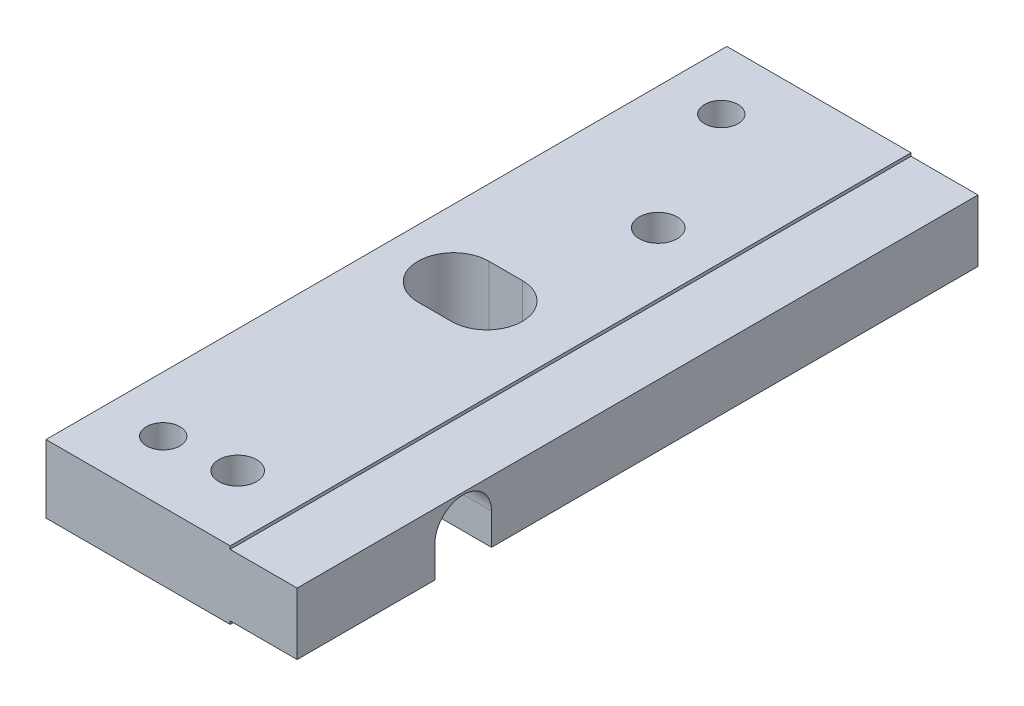
ISO-10303-21;
HEADER;
FILE_DESCRIPTION(('STEP AP214'),'2;1');
FILE_NAME('part.step','',(''),(''),'','','');
FILE_SCHEMA(('AUTOMOTIVE_DESIGN { 1 0 10303 214 1 1 1 1 }'));
ENDSEC;
DATA;
#1=APPLICATION_CONTEXT('core data for automotive mechanical design processes');
#2=APPLICATION_PROTOCOL_DEFINITION('international standard','automotive_design',2000,#1);
#3=PRODUCT_CONTEXT('',#1,'mechanical');
#4=PRODUCT('Part','Part','',(#3));
#5=PRODUCT_RELATED_PRODUCT_CATEGORY('part','',(#4));
#6=PRODUCT_DEFINITION_FORMATION('','',#4);
#7=PRODUCT_DEFINITION_CONTEXT('part definition',#1,'design');
#8=PRODUCT_DEFINITION('design','',#6,#7);
#9=PRODUCT_DEFINITION_SHAPE('','',#8);
#10=(LENGTH_UNIT() NAMED_UNIT(*) SI_UNIT(.MILLI.,.METRE.));
#11=(NAMED_UNIT(*) PLANE_ANGLE_UNIT() SI_UNIT($,.RADIAN.));
#12=(NAMED_UNIT(*) SI_UNIT($,.STERADIAN.) SOLID_ANGLE_UNIT());
#13=UNCERTAINTY_MEASURE_WITH_UNIT(LENGTH_MEASURE(1.E-05),#10,'distance_accuracy_value','');
#14=(GEOMETRIC_REPRESENTATION_CONTEXT(3) GLOBAL_UNCERTAINTY_ASSIGNED_CONTEXT((#13)) GLOBAL_UNIT_ASSIGNED_CONTEXT((#10,
#11,#12)) REPRESENTATION_CONTEXT('',''));
#15=CARTESIAN_POINT('',(0.,0.,0.));
#16=DIRECTION('',(0.,0.,1.));
#17=DIRECTION('',(1.,0.,0.));
#18=AXIS2_PLACEMENT_3D('',#15,#16,#17);
#19=CARTESIAN_POINT('',(22.5,-3.05,0.));
#20=DIRECTION('',(0.,1.,0.));
#21=DIRECTION('',(0.,0.,1.));
#22=AXIS2_PLACEMENT_3D('',#19,#20,#21);
#23=PLANE('',#22);
#24=CARTESIAN_POINT('',(11.,-3.05,-6.175));
#25=DIRECTION('',(0.,-1.,0.));
#26=DIRECTION('',(0.,0.,-1.));
#27=AXIS2_PLACEMENT_3D('',#24,#25,#26);
#28=CIRCLE('',#27,3.25);
#29=CARTESIAN_POINT('',(11.,-3.05,-9.425));
#30=VERTEX_POINT('',#29);
#31=EDGE_CURVE('E404',#30,#30,#28,.T.);
#32=ORIENTED_EDGE('',*,*,#31,.F.);
#33=EDGE_LOOP('',(#32));
#34=FACE_BOUND('',#33,.T.);
#35=CARTESIAN_POINT('',(5.00000000000001,-3.05,-5.5));
#36=DIRECTION('',(0.,1.,0.));
#37=DIRECTION('',(0.,0.,1.));
#38=AXIS2_PLACEMENT_3D('',#35,#36,#37);
#39=CIRCLE('',#38,1.5);
#40=CARTESIAN_POINT('',(5.00000000000001,-3.05,-4.));
#41=VERTEX_POINT('',#40);
#42=EDGE_CURVE('E378',#41,#41,#39,.T.);
#43=ORIENTED_EDGE('',*,*,#42,.T.);
#44=EDGE_LOOP('',(#43));
#45=FACE_BOUND('',#44,.T.);
#46=DIRECTION('',(0.,0.,-1.));
#47=VECTOR('',#46,1.);
#48=CARTESIAN_POINT('',(0.,-3.05,0.));
#49=LINE('',#48,#47);
#50=CARTESIAN_POINT('',(0.,-3.05,0.));
#51=VERTEX_POINT('',#50);
#52=CARTESIAN_POINT('',(0.,-3.05,-12.3486));
#53=VERTEX_POINT('',#52);
#54=EDGE_CURVE('E277',#51,#53,#49,.T.);
#55=ORIENTED_EDGE('',*,*,#54,.T.);
#56=DIRECTION('',(-1.,0.,0.));
#57=VECTOR('',#56,1.);
#58=CARTESIAN_POINT('',(22.5,-3.05,-12.3486));
#59=LINE('',#58,#57);
#60=CARTESIAN_POINT('',(16.5,-3.05,-12.3486));
#61=VERTEX_POINT('',#60);
#62=EDGE_CURVE('E221',#61,#53,#59,.T.);
#63=ORIENTED_EDGE('',*,*,#62,.F.);
#64=DIRECTION('',(0.,0.,-1.));
#65=VECTOR('',#64,1.);
#66=CARTESIAN_POINT('',(16.5,-3.05,0.));
#67=LINE('',#66,#65);
#68=CARTESIAN_POINT('',(16.5,-3.05,0.));
#69=VERTEX_POINT('',#68);
#70=EDGE_CURVE('E261',#69,#61,#67,.T.);
#71=ORIENTED_EDGE('',*,*,#70,.F.);
#72=DIRECTION('',(-1.,0.,0.));
#73=VECTOR('',#72,1.);
#74=CARTESIAN_POINT('',(22.5,-3.05,0.));
#75=LINE('',#74,#73);
#76=EDGE_CURVE('E291',#69,#51,#75,.T.);
#77=ORIENTED_EDGE('',*,*,#76,.T.);
#78=EDGE_LOOP('',(#55,#63,#71,#77));
#79=FACE_BOUND('',#78,.T.);
#80=ADVANCED_FACE('F36',(#34,#45,#79),#23,.F.);
#81=CARTESIAN_POINT('',(16.5,-2.775,0.));
#82=DIRECTION('',(0.,-1.,0.));
#83=DIRECTION('',(0.,0.,-1.));
#84=AXIS2_PLACEMENT_3D('',#81,#82,#83);
#85=PLANE('',#84);
#86=DIRECTION('',(-1.,0.,0.));
#87=VECTOR('',#86,1.);
#88=CARTESIAN_POINT('',(16.5,-2.775,-12.3486));
#89=LINE('',#88,#87);
#90=CARTESIAN_POINT('',(22.5,-2.775,-12.3486));
#91=VERTEX_POINT('',#90);
#92=CARTESIAN_POINT('',(16.5,-2.775,-12.3486));
#93=VERTEX_POINT('',#92);
#94=EDGE_CURVE('E228',#91,#93,#89,.T.);
#95=ORIENTED_EDGE('',*,*,#94,.F.);
#96=DIRECTION('',(0.,0.,-1.));
#97=VECTOR('',#96,1.);
#98=CARTESIAN_POINT('',(22.5,-2.775,0.));
#99=LINE('',#98,#97);
#100=CARTESIAN_POINT('',(22.5,-2.775,0.));
#101=VERTEX_POINT('',#100);
#102=EDGE_CURVE('E239',#101,#91,#99,.T.);
#103=ORIENTED_EDGE('',*,*,#102,.F.);
#104=DIRECTION('',(1.,0.,0.));
#105=VECTOR('',#104,1.);
#106=CARTESIAN_POINT('',(16.5,-2.775,0.));
#107=LINE('',#106,#105);
#108=CARTESIAN_POINT('',(16.5,-2.775,0.));
#109=VERTEX_POINT('',#108);
#110=EDGE_CURVE('E238',#109,#101,#107,.T.);
#111=ORIENTED_EDGE('',*,*,#110,.F.);
#112=DIRECTION('',(0.,0.,-1.));
#113=VECTOR('',#112,1.);
#114=CARTESIAN_POINT('',(16.5,-2.775,0.));
#115=LINE('',#114,#113);
#116=EDGE_CURVE('E231',#109,#93,#115,.T.);
#117=ORIENTED_EDGE('',*,*,#116,.T.);
#118=EDGE_LOOP('',(#95,#103,#111,#117));
#119=FACE_BOUND('',#118,.T.);
#120=ADVANCED_FACE('F355',(#119),#85,.T.);
#121=CARTESIAN_POINT('',(16.5,0.,-30.5));
#122=DIRECTION('',(1.,0.,0.));
#123=DIRECTION('',(0.,0.,-1.));
#124=AXIS2_PLACEMENT_3D('',#121,#122,#123);
#125=PLANE('',#124);
#126=DIRECTION('',(0.,-1.,0.));
#127=VECTOR('',#126,1.);
#128=CARTESIAN_POINT('',(16.5,0.,-12.3486));
#129=LINE('',#128,#127);
#130=EDGE_CURVE('E12',#93,#61,#129,.T.);
#131=ORIENTED_EDGE('',*,*,#130,.F.);
#132=ORIENTED_EDGE('',*,*,#116,.F.);
#133=DIRECTION('',(0.,-1.,0.));
#134=VECTOR('',#133,1.);
#135=CARTESIAN_POINT('',(16.5,-3.05,0.));
#136=LINE('',#135,#134);
#137=EDGE_CURVE('E260',#109,#69,#136,.T.);
#138=ORIENTED_EDGE('',*,*,#137,.T.);
#139=ORIENTED_EDGE('',*,*,#70,.T.);
#140=EDGE_LOOP('',(#131,#132,#138,#139));
#141=FACE_BOUND('',#140,.T.);
#142=ADVANCED_FACE('F352',(#141),#125,.T.);
#143=CARTESIAN_POINT('',(22.5,-3.05,0.));
#144=DIRECTION('',(0.,0.,-1.));
#145=DIRECTION('',(-1.,0.,0.));
#146=AXIS2_PLACEMENT_3D('',#143,#144,#145);
#147=PLANE('',#146);
#148=DIRECTION('',(1.,0.,0.));
#149=VECTOR('',#148,1.);
#150=CARTESIAN_POINT('',(16.5,2.775,0.));
#151=LINE('',#150,#149);
#152=CARTESIAN_POINT('',(16.5,2.775,0.));
#153=VERTEX_POINT('',#152);
#154=CARTESIAN_POINT('',(22.5,2.775,0.));
#155=VERTEX_POINT('',#154);
#156=EDGE_CURVE('E245',#153,#155,#151,.T.);
#157=ORIENTED_EDGE('',*,*,#156,.F.);
#158=CARTESIAN_POINT('',(16.5,3.05,0.));
#159=VERTEX_POINT('',#158);
#160=EDGE_CURVE('E257',#159,#153,#136,.T.);
#161=ORIENTED_EDGE('',*,*,#160,.F.);
#162=DIRECTION('',(-1.,0.,0.));
#163=VECTOR('',#162,1.);
#164=CARTESIAN_POINT('',(22.5,3.05,0.));
#165=LINE('',#164,#163);
#166=CARTESIAN_POINT('',(0.,3.05,0.));
#167=VERTEX_POINT('',#166);
#168=EDGE_CURVE('E272',#159,#167,#165,.T.);
#169=ORIENTED_EDGE('',*,*,#168,.T.);
#170=DIRECTION('',(0.,-1.,0.));
#171=VECTOR('',#170,1.);
#172=CARTESIAN_POINT('',(0.,-3.05,0.));
#173=LINE('',#172,#171);
#174=EDGE_CURVE('E273',#167,#51,#173,.T.);
#175=ORIENTED_EDGE('',*,*,#174,.T.);
#176=ORIENTED_EDGE('',*,*,#76,.F.);
#177=ORIENTED_EDGE('',*,*,#137,.F.);
#178=ORIENTED_EDGE('',*,*,#110,.T.);
#179=DIRECTION('',(0.,-1.,0.));
#180=VECTOR('',#179,1.);
#181=CARTESIAN_POINT('',(22.5,-3.05,0.));
#182=LINE('',#181,#180);
#183=EDGE_CURVE('E265',#155,#101,#182,.T.);
#184=ORIENTED_EDGE('',*,*,#183,.F.);
#185=EDGE_LOOP('',(#157,#161,#169,#175,#176,#177,#178,#184));
#186=FACE_BOUND('',#185,.T.);
#187=ADVANCED_FACE('F38',(#186),#147,.F.);
#188=CARTESIAN_POINT('',(11.,-3.05,-43.85));
#189=DIRECTION('',(0.,-1.,0.));
#190=DIRECTION('',(0.,0.,-1.));
#191=AXIS2_PLACEMENT_3D('',#188,#189,#190);
#192=CIRCLE('',#191,3.25);
#193=CARTESIAN_POINT('',(11.,-3.05,-47.1));
#194=VERTEX_POINT('',#193);
#195=EDGE_CURVE('E373',#194,#194,#192,.T.);
#196=ORIENTED_EDGE('',*,*,#195,.F.);
#197=EDGE_LOOP('',(#196));
#198=FACE_BOUND('',#197,.T.);
#199=CARTESIAN_POINT('',(5.,-3.05,-55.5));
#200=DIRECTION('',(0.,1.,0.));
#201=DIRECTION('',(0.,0.,1.));
#202=AXIS2_PLACEMENT_3D('',#199,#200,#201);
#203=CIRCLE('',#202,1.5);
#204=CARTESIAN_POINT('',(5.,-3.05,-54.));
#205=VERTEX_POINT('',#204);
#206=EDGE_CURVE('E191',#205,#205,#203,.T.);
#207=ORIENTED_EDGE('',*,*,#206,.T.);
#208=EDGE_LOOP('',(#207));
#209=FACE_BOUND('',#208,.T.);
#210=DIRECTION('',(1.,0.,0.));
#211=VECTOR('',#210,1.);
#212=CARTESIAN_POINT('',(9.00000000000001,-3.05,-27.325));
#213=LINE('',#212,#211);
#214=CARTESIAN_POINT('',(6.,-3.05,-27.325));
#215=VERTEX_POINT('',#214);
#216=CARTESIAN_POINT('',(9.00000000000001,-3.05,-27.325));
#217=VERTEX_POINT('',#216);
#218=EDGE_CURVE('E168',#215,#217,#213,.T.);
#219=ORIENTED_EDGE('',*,*,#218,.T.);
#220=CARTESIAN_POINT('',(9.00000000000001,-3.05,-30.5));
#221=DIRECTION('',(0.,1.,0.));
#222=DIRECTION('',(0.,0.,1.));
#223=AXIS2_PLACEMENT_3D('',#220,#221,#222);
#224=CIRCLE('',#223,3.175);
#225=CARTESIAN_POINT('',(9.00000000000001,-3.05,-33.675));
#226=VERTEX_POINT('',#225);
#227=EDGE_CURVE('E162',#217,#226,#224,.T.);
#228=ORIENTED_EDGE('',*,*,#227,.T.);
#229=DIRECTION('',(-1.,0.,0.));
#230=VECTOR('',#229,1.);
#231=CARTESIAN_POINT('',(9.00000000000001,-3.05,-33.675));
#232=LINE('',#231,#230);
#233=CARTESIAN_POINT('',(6.00000000000001,-3.05,-33.675));
#234=VERTEX_POINT('',#233);
#235=EDGE_CURVE('E171',#226,#234,#232,.T.);
#236=ORIENTED_EDGE('',*,*,#235,.T.);
#237=CARTESIAN_POINT('',(6.,-3.05,-30.5));
#238=DIRECTION('',(0.,1.,0.));
#239=DIRECTION('',(0.,0.,1.));
#240=AXIS2_PLACEMENT_3D('',#237,#238,#239);
#241=CIRCLE('',#240,3.175);
#242=EDGE_CURVE('E51',#234,#215,#241,.T.);
#243=ORIENTED_EDGE('',*,*,#242,.T.);
#244=EDGE_LOOP('',(#219,#228,#236,#243));
#245=FACE_BOUND('',#244,.T.);
#246=CARTESIAN_POINT('',(16.5,-3.05,-17.4134));
#247=VERTEX_POINT('',#246);
#248=CARTESIAN_POINT('',(16.5,-3.05,-61.));
#249=VERTEX_POINT('',#248);
#250=EDGE_CURVE('E264',#247,#249,#67,.T.);
#251=ORIENTED_EDGE('',*,*,#250,.F.);
#252=DIRECTION('',(-1.,0.,0.));
#253=VECTOR('',#252,1.);
#254=CARTESIAN_POINT('',(22.5,-3.05,-17.4134));
#255=LINE('',#254,#253);
#256=CARTESIAN_POINT('',(0.,-3.05,-17.4134));
#257=VERTEX_POINT('',#256);
#258=EDGE_CURVE('E223',#247,#257,#255,.T.);
#259=ORIENTED_EDGE('',*,*,#258,.T.);
#260=CARTESIAN_POINT('',(0.,-3.05,-61.));
#261=VERTEX_POINT('',#260);
#262=EDGE_CURVE('E276',#257,#261,#49,.T.);
#263=ORIENTED_EDGE('',*,*,#262,.T.);
#264=DIRECTION('',(-1.,0.,0.));
#265=VECTOR('',#264,1.);
#266=CARTESIAN_POINT('',(22.5,-3.05,-61.));
#267=LINE('',#266,#265);
#268=EDGE_CURVE('E288',#249,#261,#267,.T.);
#269=ORIENTED_EDGE('',*,*,#268,.F.);
#270=EDGE_LOOP('',(#251,#259,#263,#269));
#271=FACE_BOUND('',#270,.T.);
#272=ADVANCED_FACE('F175',(#198,#209,#245,#271),#23,.F.);
#273=CARTESIAN_POINT('',(22.5,-3.05,-61.));
#274=DIRECTION('',(0.,0.,1.));
#275=DIRECTION('',(1.,0.,0.));
#276=AXIS2_PLACEMENT_3D('',#273,#274,#275);
#277=PLANE('',#276);
#278=DIRECTION('',(1.,0.,0.));
#279=VECTOR('',#278,1.);
#280=CARTESIAN_POINT('',(16.5,2.775,-61.));
#281=LINE('',#280,#279);
#282=CARTESIAN_POINT('',(16.5,2.775,-61.));
#283=VERTEX_POINT('',#282);
#284=CARTESIAN_POINT('',(22.5,2.775,-61.));
#285=VERTEX_POINT('',#284);
#286=EDGE_CURVE('E248',#283,#285,#281,.T.);
#287=ORIENTED_EDGE('',*,*,#286,.T.);
#288=DIRECTION('',(0.,1.,0.));
#289=VECTOR('',#288,1.);
#290=CARTESIAN_POINT('',(22.5,-3.05,-61.));
#291=LINE('',#290,#289);
#292=CARTESIAN_POINT('',(22.5,-2.775,-61.));
#293=VERTEX_POINT('',#292);
#294=EDGE_CURVE('E268',#293,#285,#291,.T.);
#295=ORIENTED_EDGE('',*,*,#294,.F.);
#296=DIRECTION('',(1.,0.,0.));
#297=VECTOR('',#296,1.);
#298=CARTESIAN_POINT('',(16.5,-2.775,-61.));
#299=LINE('',#298,#297);
#300=CARTESIAN_POINT('',(16.5,-2.775,-61.));
#301=VERTEX_POINT('',#300);
#302=EDGE_CURVE('E251',#301,#293,#299,.T.);
#303=ORIENTED_EDGE('',*,*,#302,.F.);
#304=DIRECTION('',(0.,1.,0.));
#305=VECTOR('',#304,1.);
#306=CARTESIAN_POINT('',(16.5,-3.05,-61.));
#307=LINE('',#306,#305);
#308=EDGE_CURVE('E258',#249,#301,#307,.T.);
#309=ORIENTED_EDGE('',*,*,#308,.F.);
#310=ORIENTED_EDGE('',*,*,#268,.T.);
#311=DIRECTION('',(0.,1.,0.));
#312=VECTOR('',#311,1.);
#313=CARTESIAN_POINT('',(0.,-3.05,-61.));
#314=LINE('',#313,#312);
#315=CARTESIAN_POINT('',(0.,3.05,-61.));
#316=VERTEX_POINT('',#315);
#317=EDGE_CURVE('E280',#261,#316,#314,.T.);
#318=ORIENTED_EDGE('',*,*,#317,.T.);
#319=DIRECTION('',(-1.,0.,0.));
#320=VECTOR('',#319,1.);
#321=CARTESIAN_POINT('',(22.5,3.05,-61.));
#322=LINE('',#321,#320);
#323=CARTESIAN_POINT('',(16.5,3.05,-61.));
#324=VERTEX_POINT('',#323);
#325=EDGE_CURVE('E286',#324,#316,#322,.T.);
#326=ORIENTED_EDGE('',*,*,#325,.F.);
#327=EDGE_CURVE('E247',#283,#324,#307,.T.);
#328=ORIENTED_EDGE('',*,*,#327,.F.);
#329=EDGE_LOOP('',(#287,#295,#303,#309,#310,#318,#326,#328));
#330=FACE_BOUND('',#329,.T.);
#331=ADVANCED_FACE('F312',(#330),#277,.F.);
#332=CARTESIAN_POINT('',(22.5,3.05,0.));
#333=DIRECTION('',(0.,-1.,0.));
#334=DIRECTION('',(0.,0.,-1.));
#335=AXIS2_PLACEMENT_3D('',#332,#333,#334);
#336=PLANE('',#335);
#337=CARTESIAN_POINT('',(11.,3.05,-6.175));
#338=DIRECTION('',(0.,-1.,0.));
#339=DIRECTION('',(0.,0.,-1.));
#340=AXIS2_PLACEMENT_3D('',#337,#338,#339);
#341=CIRCLE('',#340,1.7);
#342=CARTESIAN_POINT('',(11.,3.05,-7.875));
#343=VERTEX_POINT('',#342);
#344=EDGE_CURVE('E395',#343,#343,#341,.T.);
#345=ORIENTED_EDGE('',*,*,#344,.T.);
#346=EDGE_LOOP('',(#345));
#347=FACE_BOUND('',#346,.T.);
#348=CARTESIAN_POINT('',(11.,3.05,-43.85));
#349=DIRECTION('',(0.,-1.,0.));
#350=DIRECTION('',(0.,0.,-1.));
#351=AXIS2_PLACEMENT_3D('',#348,#349,#350);
#352=CIRCLE('',#351,1.7);
#353=CARTESIAN_POINT('',(11.,3.05,-45.55));
#354=VERTEX_POINT('',#353);
#355=EDGE_CURVE('E383',#354,#354,#352,.T.);
#356=ORIENTED_EDGE('',*,*,#355,.T.);
#357=EDGE_LOOP('',(#356));
#358=FACE_BOUND('',#357,.T.);
#359=CARTESIAN_POINT('',(5.00000000000001,3.05,-5.5));
#360=DIRECTION('',(0.,1.,0.));
#361=DIRECTION('',(0.,0.,1.));
#362=AXIS2_PLACEMENT_3D('',#359,#360,#361);
#363=CIRCLE('',#362,1.5);
#364=CARTESIAN_POINT('',(5.00000000000001,3.05,-4.));
#365=VERTEX_POINT('',#364);
#366=EDGE_CURVE('E380',#365,#365,#363,.T.);
#367=ORIENTED_EDGE('',*,*,#366,.F.);
#368=EDGE_LOOP('',(#367));
#369=FACE_BOUND('',#368,.T.);
#370=CARTESIAN_POINT('',(5.,3.05,-55.5));
#371=DIRECTION('',(0.,1.,0.));
#372=DIRECTION('',(0.,0.,1.));
#373=AXIS2_PLACEMENT_3D('',#370,#371,#372);
#374=CIRCLE('',#373,1.5);
#375=CARTESIAN_POINT('',(5.,3.05,-54.));
#376=VERTEX_POINT('',#375);
#377=EDGE_CURVE('E184',#376,#376,#374,.T.);
#378=ORIENTED_EDGE('',*,*,#377,.F.);
#379=EDGE_LOOP('',(#378));
#380=FACE_BOUND('',#379,.T.);
#381=DIRECTION('',(-1.,0.,0.));
#382=VECTOR('',#381,1.);
#383=CARTESIAN_POINT('',(9.00000000000001,3.05,-33.675));
#384=LINE('',#383,#382);
#385=CARTESIAN_POINT('',(9.00000000000001,3.05,-33.675));
#386=VERTEX_POINT('',#385);
#387=CARTESIAN_POINT('',(6.,3.05,-33.675));
#388=VERTEX_POINT('',#387);
#389=EDGE_CURVE('E190',#386,#388,#384,.T.);
#390=ORIENTED_EDGE('',*,*,#389,.F.);
#391=CARTESIAN_POINT('',(9.00000000000001,3.05,-30.5));
#392=DIRECTION('',(0.,1.,0.));
#393=DIRECTION('',(0.,0.,1.));
#394=AXIS2_PLACEMENT_3D('',#391,#392,#393);
#395=CIRCLE('',#394,3.175);
#396=CARTESIAN_POINT('',(9.00000000000001,3.05,-27.325));
#397=VERTEX_POINT('',#396);
#398=EDGE_CURVE('E59',#397,#386,#395,.T.);
#399=ORIENTED_EDGE('',*,*,#398,.F.);
#400=DIRECTION('',(1.,0.,0.));
#401=VECTOR('',#400,1.);
#402=CARTESIAN_POINT('',(9.00000000000001,3.05,-27.325));
#403=LINE('',#402,#401);
#404=CARTESIAN_POINT('',(6.,3.05,-27.325));
#405=VERTEX_POINT('',#404);
#406=EDGE_CURVE('E178',#405,#397,#403,.T.);
#407=ORIENTED_EDGE('',*,*,#406,.F.);
#408=CARTESIAN_POINT('',(6.,3.05,-30.5));
#409=DIRECTION('',(0.,1.,0.));
#410=DIRECTION('',(0.,0.,1.));
#411=AXIS2_PLACEMENT_3D('',#408,#409,#410);
#412=CIRCLE('',#411,3.175);
#413=EDGE_CURVE('E181',#388,#405,#412,.T.);
#414=ORIENTED_EDGE('',*,*,#413,.F.);
#415=EDGE_LOOP('',(#390,#399,#407,#414));
#416=FACE_BOUND('',#415,.T.);
#417=DIRECTION('',(0.,0.,1.));
#418=VECTOR('',#417,1.);
#419=CARTESIAN_POINT('',(16.5,3.05,0.));
#420=LINE('',#419,#418);
#421=EDGE_CURVE('E293',#324,#159,#420,.T.);
#422=ORIENTED_EDGE('',*,*,#421,.F.);
#423=ORIENTED_EDGE('',*,*,#325,.T.);
#424=DIRECTION('',(0.,0.,1.));
#425=VECTOR('',#424,1.);
#426=CARTESIAN_POINT('',(0.,3.05,0.));
#427=LINE('',#426,#425);
#428=EDGE_CURVE('E269',#316,#167,#427,.T.);
#429=ORIENTED_EDGE('',*,*,#428,.T.);
#430=ORIENTED_EDGE('',*,*,#168,.F.);
#431=EDGE_LOOP('',(#422,#423,#429,#430));
#432=FACE_BOUND('',#431,.T.);
#433=ADVANCED_FACE('F334',(#347,#358,#369,#380,#416,#432),#336,.F.);
#434=CARTESIAN_POINT('',(22.5,3.05,0.));
#435=DIRECTION('',(-1.,0.,0.));
#436=DIRECTION('',(0.,0.,1.));
#437=AXIS2_PLACEMENT_3D('',#434,#435,#436);
#438=PLANE('',#437);
#439=ORIENTED_EDGE('',*,*,#102,.T.);
#440=DIRECTION('',(0.,1.,0.));
#441=VECTOR('',#440,1.);
#442=CARTESIAN_POINT('',(22.5,0.0496000000000007,-12.3486));
#443=LINE('',#442,#441);
#444=CARTESIAN_POINT('',(22.5,0.0496000000000007,-12.3486));
#445=VERTEX_POINT('',#444);
#446=EDGE_CURVE('E208',#91,#445,#443,.T.);
#447=ORIENTED_EDGE('',*,*,#446,.T.);
#448=CARTESIAN_POINT('',(22.5,0.0496000000000003,-14.881));
#449=DIRECTION('',(-1.,0.,0.));
#450=DIRECTION('',(0.,0.,1.));
#451=AXIS2_PLACEMENT_3D('',#448,#449,#450);
#452=CIRCLE('',#451,2.5324);
#453=CARTESIAN_POINT('',(22.5,0.0496000000000003,-17.4134));
#454=VERTEX_POINT('',#453);
#455=EDGE_CURVE('E201',#445,#454,#452,.T.);
#456=ORIENTED_EDGE('',*,*,#455,.T.);
#457=DIRECTION('',(0.,-1.,0.));
#458=VECTOR('',#457,1.);
#459=CARTESIAN_POINT('',(22.5,-3.05,-17.4134));
#460=LINE('',#459,#458);
#461=CARTESIAN_POINT('',(22.5,-2.775,-17.4134));
#462=VERTEX_POINT('',#461);
#463=EDGE_CURVE('E204',#454,#462,#460,.T.);
#464=ORIENTED_EDGE('',*,*,#463,.T.);
#465=EDGE_CURVE('E230',#462,#293,#99,.T.);
#466=ORIENTED_EDGE('',*,*,#465,.T.);
#467=ORIENTED_EDGE('',*,*,#294,.T.);
#468=DIRECTION('',(0.,0.,1.));
#469=VECTOR('',#468,1.);
#470=CARTESIAN_POINT('',(22.5,2.775,0.));
#471=LINE('',#470,#469);
#472=EDGE_CURVE('E242',#285,#155,#471,.T.);
#473=ORIENTED_EDGE('',*,*,#472,.T.);
#474=ORIENTED_EDGE('',*,*,#183,.T.);
#475=EDGE_LOOP('',(#439,#447,#456,#464,#466,#467,#473,#474));
#476=FACE_BOUND('',#475,.T.);
#477=ADVANCED_FACE('F315',(#476),#438,.F.);
#478=CARTESIAN_POINT('',(0.,3.05,0.));
#479=DIRECTION('',(-1.,0.,0.));
#480=DIRECTION('',(0.,0.,1.));
#481=AXIS2_PLACEMENT_3D('',#478,#479,#480);
#482=PLANE('',#481);
#483=DIRECTION('',(0.,1.,0.));
#484=VECTOR('',#483,1.);
#485=CARTESIAN_POINT('',(0.,0.0496000000000007,-12.3486));
#486=LINE('',#485,#484);
#487=CARTESIAN_POINT('',(0.,0.0496000000000007,-12.3486));
#488=VERTEX_POINT('',#487);
#489=EDGE_CURVE('E205',#53,#488,#486,.T.);
#490=ORIENTED_EDGE('',*,*,#489,.F.);
#491=ORIENTED_EDGE('',*,*,#54,.F.);
#492=ORIENTED_EDGE('',*,*,#174,.F.);
#493=ORIENTED_EDGE('',*,*,#428,.F.);
#494=ORIENTED_EDGE('',*,*,#317,.F.);
#495=ORIENTED_EDGE('',*,*,#262,.F.);
#496=DIRECTION('',(0.,-1.,0.));
#497=VECTOR('',#496,1.);
#498=CARTESIAN_POINT('',(0.,-3.05,-17.4134));
#499=LINE('',#498,#497);
#500=CARTESIAN_POINT('',(0.,0.0496000000000003,-17.4134));
#501=VERTEX_POINT('',#500);
#502=EDGE_CURVE('E214',#501,#257,#499,.T.);
#503=ORIENTED_EDGE('',*,*,#502,.F.);
#504=CARTESIAN_POINT('',(0.,0.0496000000000003,-14.881));
#505=DIRECTION('',(-1.,0.,0.));
#506=DIRECTION('',(0.,0.,1.));
#507=AXIS2_PLACEMENT_3D('',#504,#505,#506);
#508=CIRCLE('',#507,2.5324);
#509=EDGE_CURVE('E197',#488,#501,#508,.T.);
#510=ORIENTED_EDGE('',*,*,#509,.F.);
#511=EDGE_LOOP('',(#490,#491,#492,#493,#494,#495,#503,#510));
#512=FACE_BOUND('',#511,.T.);
#513=ADVANCED_FACE('F325',(#512),#482,.T.);
#514=DIRECTION('',(1.,0.,0.));
#515=VECTOR('',#514,1.);
#516=CARTESIAN_POINT('',(16.5,-2.775,-17.4134));
#517=LINE('',#516,#515);
#518=CARTESIAN_POINT('',(16.5,-2.775,-17.4134));
#519=VERTEX_POINT('',#518);
#520=EDGE_CURVE('E220',#519,#462,#517,.T.);
#521=ORIENTED_EDGE('',*,*,#520,.F.);
#522=EDGE_CURVE('E235',#519,#301,#115,.T.);
#523=ORIENTED_EDGE('',*,*,#522,.T.);
#524=ORIENTED_EDGE('',*,*,#302,.T.);
#525=ORIENTED_EDGE('',*,*,#465,.F.);
#526=EDGE_LOOP('',(#521,#523,#524,#525));
#527=FACE_BOUND('',#526,.T.);
#528=ADVANCED_FACE('F304',(#527),#85,.T.);
#529=DIRECTION('',(0.,1.,0.));
#530=VECTOR('',#529,1.);
#531=CARTESIAN_POINT('',(16.5,0.,-17.4134));
#532=LINE('',#531,#530);
#533=EDGE_CURVE('E44',#247,#519,#532,.T.);
#534=ORIENTED_EDGE('',*,*,#533,.F.);
#535=ORIENTED_EDGE('',*,*,#250,.T.);
#536=ORIENTED_EDGE('',*,*,#308,.T.);
#537=ORIENTED_EDGE('',*,*,#522,.F.);
#538=EDGE_LOOP('',(#534,#535,#536,#537));
#539=FACE_BOUND('',#538,.T.);
#540=ADVANCED_FACE('F306',(#539),#125,.T.);
#541=ORIENTED_EDGE('',*,*,#160,.T.);
#542=DIRECTION('',(0.,0.,1.));
#543=VECTOR('',#542,1.);
#544=CARTESIAN_POINT('',(16.5,2.775,0.));
#545=LINE('',#544,#543);
#546=EDGE_CURVE('E234',#283,#153,#545,.T.);
#547=ORIENTED_EDGE('',*,*,#546,.F.);
#548=ORIENTED_EDGE('',*,*,#327,.T.);
#549=ORIENTED_EDGE('',*,*,#421,.T.);
#550=EDGE_LOOP('',(#541,#547,#548,#549));
#551=FACE_BOUND('',#550,.T.);
#552=ADVANCED_FACE('F337',(#551),#125,.T.);
#553=CARTESIAN_POINT('',(16.5,2.775,0.));
#554=DIRECTION('',(0.,1.,0.));
#555=DIRECTION('',(0.,0.,1.));
#556=AXIS2_PLACEMENT_3D('',#553,#554,#555);
#557=PLANE('',#556);
#558=ORIENTED_EDGE('',*,*,#472,.F.);
#559=ORIENTED_EDGE('',*,*,#286,.F.);
#560=ORIENTED_EDGE('',*,*,#546,.T.);
#561=ORIENTED_EDGE('',*,*,#156,.T.);
#562=EDGE_LOOP('',(#558,#559,#560,#561));
#563=FACE_BOUND('',#562,.T.);
#564=ADVANCED_FACE('F342',(#563),#557,.T.);
#565=CARTESIAN_POINT('',(22.5,0.0496000000000003,-14.881));
#566=DIRECTION('',(-1.,0.,0.));
#567=DIRECTION('',(0.,0.,1.));
#568=AXIS2_PLACEMENT_3D('',#565,#566,#567);
#569=CYLINDRICAL_SURFACE('',#568,2.5324);
#570=ORIENTED_EDGE('',*,*,#509,.T.);
#571=DIRECTION('',(-1.,0.,0.));
#572=VECTOR('',#571,1.);
#573=CARTESIAN_POINT('',(22.5,0.0496000000000003,-17.4134));
#574=LINE('',#573,#572);
#575=EDGE_CURVE('E211',#454,#501,#574,.T.);
#576=ORIENTED_EDGE('',*,*,#575,.F.);
#577=ORIENTED_EDGE('',*,*,#455,.F.);
#578=DIRECTION('',(-1.,0.,0.));
#579=VECTOR('',#578,1.);
#580=CARTESIAN_POINT('',(22.5,0.0496000000000007,-12.3486));
#581=LINE('',#580,#579);
#582=EDGE_CURVE('E218',#445,#488,#581,.T.);
#583=ORIENTED_EDGE('',*,*,#582,.T.);
#584=EDGE_LOOP('',(#570,#576,#577,#583));
#585=FACE_BOUND('',#584,.T.);
#586=ADVANCED_FACE('F321',(#585),#569,.F.);
#587=CARTESIAN_POINT('',(22.5,0.0496000000000007,-12.3486));
#588=DIRECTION('',(0.,0.,1.));
#589=DIRECTION('',(1.,0.,0.));
#590=AXIS2_PLACEMENT_3D('',#587,#588,#589);
#591=PLANE('',#590);
#592=ORIENTED_EDGE('',*,*,#94,.T.);
#593=ORIENTED_EDGE('',*,*,#130,.T.);
#594=ORIENTED_EDGE('',*,*,#62,.T.);
#595=ORIENTED_EDGE('',*,*,#489,.T.);
#596=ORIENTED_EDGE('',*,*,#582,.F.);
#597=ORIENTED_EDGE('',*,*,#446,.F.);
#598=EDGE_LOOP('',(#592,#593,#594,#595,#596,#597));
#599=FACE_BOUND('',#598,.T.);
#600=ADVANCED_FACE('F349',(#599),#591,.F.);
#601=CARTESIAN_POINT('',(22.5,-3.05,-17.4134));
#602=DIRECTION('',(0.,0.,-1.));
#603=DIRECTION('',(-1.,0.,0.));
#604=AXIS2_PLACEMENT_3D('',#601,#602,#603);
#605=PLANE('',#604);
#606=ORIENTED_EDGE('',*,*,#520,.T.);
#607=ORIENTED_EDGE('',*,*,#463,.F.);
#608=ORIENTED_EDGE('',*,*,#575,.T.);
#609=ORIENTED_EDGE('',*,*,#502,.T.);
#610=ORIENTED_EDGE('',*,*,#258,.F.);
#611=ORIENTED_EDGE('',*,*,#533,.T.);
#612=EDGE_LOOP('',(#606,#607,#608,#609,#610,#611));
#613=FACE_BOUND('',#612,.T.);
#614=ADVANCED_FACE('F297',(#613),#605,.F.);
#615=CARTESIAN_POINT('',(9.00000000000001,-3.05,-30.5));
#616=DIRECTION('',(0.,1.,0.));
#617=DIRECTION('',(0.,0.,1.));
#618=AXIS2_PLACEMENT_3D('',#615,#616,#617);
#619=CYLINDRICAL_SURFACE('',#618,3.175);
#620=ORIENTED_EDGE('',*,*,#398,.T.);
#621=DIRECTION('',(0.,1.,0.));
#622=VECTOR('',#621,1.);
#623=CARTESIAN_POINT('',(9.00000000000001,-3.05,-33.675));
#624=LINE('',#623,#622);
#625=EDGE_CURVE('E158',#226,#386,#624,.T.);
#626=ORIENTED_EDGE('',*,*,#625,.F.);
#627=ORIENTED_EDGE('',*,*,#227,.F.);
#628=DIRECTION('',(0.,1.,0.));
#629=VECTOR('',#628,1.);
#630=CARTESIAN_POINT('',(9.00000000000001,-3.05,-27.325));
#631=LINE('',#630,#629);
#632=EDGE_CURVE('E195',#217,#397,#631,.T.);
#633=ORIENTED_EDGE('',*,*,#632,.T.);
#634=EDGE_LOOP('',(#620,#626,#627,#633));
#635=FACE_BOUND('',#634,.T.);
#636=ADVANCED_FACE('F160',(#635),#619,.F.);
#637=CARTESIAN_POINT('',(9.00000000000001,-3.05,-27.325));
#638=DIRECTION('',(0.,0.,1.));
#639=DIRECTION('',(1.,0.,0.));
#640=AXIS2_PLACEMENT_3D('',#637,#638,#639);
#641=PLANE('',#640);
#642=ORIENTED_EDGE('',*,*,#406,.T.);
#643=ORIENTED_EDGE('',*,*,#632,.F.);
#644=ORIENTED_EDGE('',*,*,#218,.F.);
#645=DIRECTION('',(0.,1.,0.));
#646=VECTOR('',#645,1.);
#647=CARTESIAN_POINT('',(6.,-3.05,-27.325));
#648=LINE('',#647,#646);
#649=EDGE_CURVE('E198',#215,#405,#648,.T.);
#650=ORIENTED_EDGE('',*,*,#649,.T.);
#651=EDGE_LOOP('',(#642,#643,#644,#650));
#652=FACE_BOUND('',#651,.T.);
#653=ADVANCED_FACE('F442',(#652),#641,.F.);
#654=CARTESIAN_POINT('',(6.,-3.05,-30.5));
#655=DIRECTION('',(0.,1.,0.));
#656=DIRECTION('',(0.,0.,1.));
#657=AXIS2_PLACEMENT_3D('',#654,#655,#656);
#658=CYLINDRICAL_SURFACE('',#657,3.175);
#659=ORIENTED_EDGE('',*,*,#413,.T.);
#660=ORIENTED_EDGE('',*,*,#649,.F.);
#661=ORIENTED_EDGE('',*,*,#242,.F.);
#662=DIRECTION('',(0.,1.,0.));
#663=VECTOR('',#662,1.);
#664=CARTESIAN_POINT('',(6.,-3.05,-33.675));
#665=LINE('',#664,#663);
#666=EDGE_CURVE('E167',#234,#388,#665,.T.);
#667=ORIENTED_EDGE('',*,*,#666,.T.);
#668=EDGE_LOOP('',(#659,#660,#661,#667));
#669=FACE_BOUND('',#668,.T.);
#670=ADVANCED_FACE('F445',(#669),#658,.F.);
#671=CARTESIAN_POINT('',(9.00000000000001,-3.05,-33.675));
#672=DIRECTION('',(0.,0.,-1.));
#673=DIRECTION('',(-1.,0.,0.));
#674=AXIS2_PLACEMENT_3D('',#671,#672,#673);
#675=PLANE('',#674);
#676=ORIENTED_EDGE('',*,*,#389,.T.);
#677=ORIENTED_EDGE('',*,*,#666,.F.);
#678=ORIENTED_EDGE('',*,*,#235,.F.);
#679=ORIENTED_EDGE('',*,*,#625,.T.);
#680=EDGE_LOOP('',(#676,#677,#678,#679));
#681=FACE_BOUND('',#680,.T.);
#682=ADVANCED_FACE('F172',(#681),#675,.F.);
#683=CARTESIAN_POINT('',(5.,-3.05,-55.5));
#684=DIRECTION('',(0.,1.,0.));
#685=DIRECTION('',(0.,0.,1.));
#686=AXIS2_PLACEMENT_3D('',#683,#684,#685);
#687=CYLINDRICAL_SURFACE('',#686,1.5);
#688=ORIENTED_EDGE('',*,*,#206,.F.);
#689=EDGE_LOOP('',(#688));
#690=FACE_BOUND('',#689,.T.);
#691=ORIENTED_EDGE('',*,*,#377,.T.);
#692=EDGE_LOOP('',(#691));
#693=FACE_BOUND('',#692,.T.);
#694=ADVANCED_FACE('F438',(#690,#693),#687,.F.);
#695=CARTESIAN_POINT('',(5.00000000000001,-3.05,-5.5));
#696=DIRECTION('',(0.,1.,0.));
#697=DIRECTION('',(0.,0.,1.));
#698=AXIS2_PLACEMENT_3D('',#695,#696,#697);
#699=CYLINDRICAL_SURFACE('',#698,1.5);
#700=ORIENTED_EDGE('',*,*,#42,.F.);
#701=EDGE_LOOP('',(#700));
#702=FACE_BOUND('',#701,.T.);
#703=ORIENTED_EDGE('',*,*,#366,.T.);
#704=EDGE_LOOP('',(#703));
#705=FACE_BOUND('',#704,.T.);
#706=ADVANCED_FACE('F434',(#702,#705),#699,.F.);
#707=CARTESIAN_POINT('',(11.,-3.05,-43.85));
#708=DIRECTION('',(0.,-1.,0.));
#709=DIRECTION('',(0.,0.,-1.));
#710=AXIS2_PLACEMENT_3D('',#707,#708,#709);
#711=CYLINDRICAL_SURFACE('',#710,1.7);
#712=ORIENTED_EDGE('',*,*,#355,.F.);
#713=EDGE_LOOP('',(#712));
#714=FACE_BOUND('',#713,.T.);
#715=CARTESIAN_POINT('',(11.,-0.850000000000001,-43.85));
#716=DIRECTION('',(0.,-1.,0.));
#717=DIRECTION('',(0.,0.,-1.));
#718=AXIS2_PLACEMENT_3D('',#715,#716,#717);
#719=CIRCLE('',#718,1.7);
#720=CARTESIAN_POINT('',(11.,-0.850000000000001,-45.55));
#721=VERTEX_POINT('',#720);
#722=EDGE_CURVE('E388',#721,#721,#719,.T.);
#723=ORIENTED_EDGE('',*,*,#722,.T.);
#724=EDGE_LOOP('',(#723));
#725=FACE_BOUND('',#724,.T.);
#726=ADVANCED_FACE('F430',(#714,#725),#711,.F.);
#727=CARTESIAN_POINT('',(12.7,-0.850000000000001,-43.85));
#728=DIRECTION('',(0.,1.,0.));
#729=DIRECTION('',(0.,0.,1.));
#730=AXIS2_PLACEMENT_3D('',#727,#728,#729);
#731=PLANE('',#730);
#732=ORIENTED_EDGE('',*,*,#722,.F.);
#733=EDGE_LOOP('',(#732));
#734=FACE_BOUND('',#733,.T.);
#735=CARTESIAN_POINT('',(11.,-0.850000000000001,-43.85));
#736=DIRECTION('',(0.,-1.,0.));
#737=DIRECTION('',(0.,0.,-1.));
#738=AXIS2_PLACEMENT_3D('',#735,#736,#737);
#739=CIRCLE('',#738,3.25);
#740=CARTESIAN_POINT('',(11.,-0.850000000000001,-47.1));
#741=VERTEX_POINT('',#740);
#742=EDGE_CURVE('E391',#741,#741,#739,.T.);
#743=ORIENTED_EDGE('',*,*,#742,.T.);
#744=EDGE_LOOP('',(#743));
#745=FACE_BOUND('',#744,.T.);
#746=ADVANCED_FACE('F426',(#734,#745),#731,.F.);
#747=CARTESIAN_POINT('',(11.,-3.05,-43.85));
#748=DIRECTION('',(0.,-1.,0.));
#749=DIRECTION('',(0.,0.,-1.));
#750=AXIS2_PLACEMENT_3D('',#747,#748,#749);
#751=CYLINDRICAL_SURFACE('',#750,3.25);
#752=ORIENTED_EDGE('',*,*,#742,.F.);
#753=EDGE_LOOP('',(#752));
#754=FACE_BOUND('',#753,.T.);
#755=ORIENTED_EDGE('',*,*,#195,.T.);
#756=EDGE_LOOP('',(#755));
#757=FACE_BOUND('',#756,.T.);
#758=ADVANCED_FACE('F422',(#754,#757),#751,.F.);
#759=CARTESIAN_POINT('',(11.,-3.05,-6.175));
#760=DIRECTION('',(0.,-1.,0.));
#761=DIRECTION('',(0.,0.,-1.));
#762=AXIS2_PLACEMENT_3D('',#759,#760,#761);
#763=CYLINDRICAL_SURFACE('',#762,1.7);
#764=ORIENTED_EDGE('',*,*,#344,.F.);
#765=EDGE_LOOP('',(#764));
#766=FACE_BOUND('',#765,.T.);
#767=CARTESIAN_POINT('',(11.,-0.850000000000001,-6.175));
#768=DIRECTION('',(0.,-1.,0.));
#769=DIRECTION('',(0.,0.,-1.));
#770=AXIS2_PLACEMENT_3D('',#767,#768,#769);
#771=CIRCLE('',#770,1.7);
#772=CARTESIAN_POINT('',(11.,-0.850000000000001,-7.875));
#773=VERTEX_POINT('',#772);
#774=EDGE_CURVE('E398',#773,#773,#771,.T.);
#775=ORIENTED_EDGE('',*,*,#774,.T.);
#776=EDGE_LOOP('',(#775));
#777=FACE_BOUND('',#776,.T.);
#778=ADVANCED_FACE('F415',(#766,#777),#763,.F.);
#779=CARTESIAN_POINT('',(12.7,-0.850000000000001,-6.175));
#780=DIRECTION('',(0.,1.,0.));
#781=DIRECTION('',(0.,0.,1.));
#782=AXIS2_PLACEMENT_3D('',#779,#780,#781);
#783=PLANE('',#782);
#784=ORIENTED_EDGE('',*,*,#774,.F.);
#785=EDGE_LOOP('',(#784));
#786=FACE_BOUND('',#785,.T.);
#787=CARTESIAN_POINT('',(11.,-0.850000000000001,-6.175));
#788=DIRECTION('',(0.,-1.,0.));
#789=DIRECTION('',(0.,0.,-1.));
#790=AXIS2_PLACEMENT_3D('',#787,#788,#789);
#791=CIRCLE('',#790,3.25);
#792=CARTESIAN_POINT('',(11.,-0.850000000000001,-9.425));
#793=VERTEX_POINT('',#792);
#794=EDGE_CURVE('E401',#793,#793,#791,.T.);
#795=ORIENTED_EDGE('',*,*,#794,.T.);
#796=EDGE_LOOP('',(#795));
#797=FACE_BOUND('',#796,.T.);
#798=ADVANCED_FACE('F409',(#786,#797),#783,.F.);
#799=CARTESIAN_POINT('',(11.,-3.05,-6.175));
#800=DIRECTION('',(0.,-1.,0.));
#801=DIRECTION('',(0.,0.,-1.));
#802=AXIS2_PLACEMENT_3D('',#799,#800,#801);
#803=CYLINDRICAL_SURFACE('',#802,3.25);
#804=ORIENTED_EDGE('',*,*,#794,.F.);
#805=EDGE_LOOP('',(#804));
#806=FACE_BOUND('',#805,.T.);
#807=ORIENTED_EDGE('',*,*,#31,.T.);
#808=EDGE_LOOP('',(#807));
#809=FACE_BOUND('',#808,.T.);
#810=ADVANCED_FACE('F407',(#806,#809),#803,.F.);
#811=CLOSED_SHELL('',(#80,#120,#142,#187,#272,#331,#433,#477,#513,#528,#540,#552,#564,#586,#600,
#614,#636,#653,#670,#682,#694,#706,#726,#746,#758,#778,#798,#810));
#812=MANIFOLD_SOLID_BREP('B2',#811);
#813=ADVANCED_BREP_SHAPE_REPRESENTATION('',(#18,#812),#14);
#814=SHAPE_DEFINITION_REPRESENTATION(#9,#813);
ENDSEC;
END-ISO-10303-21;
